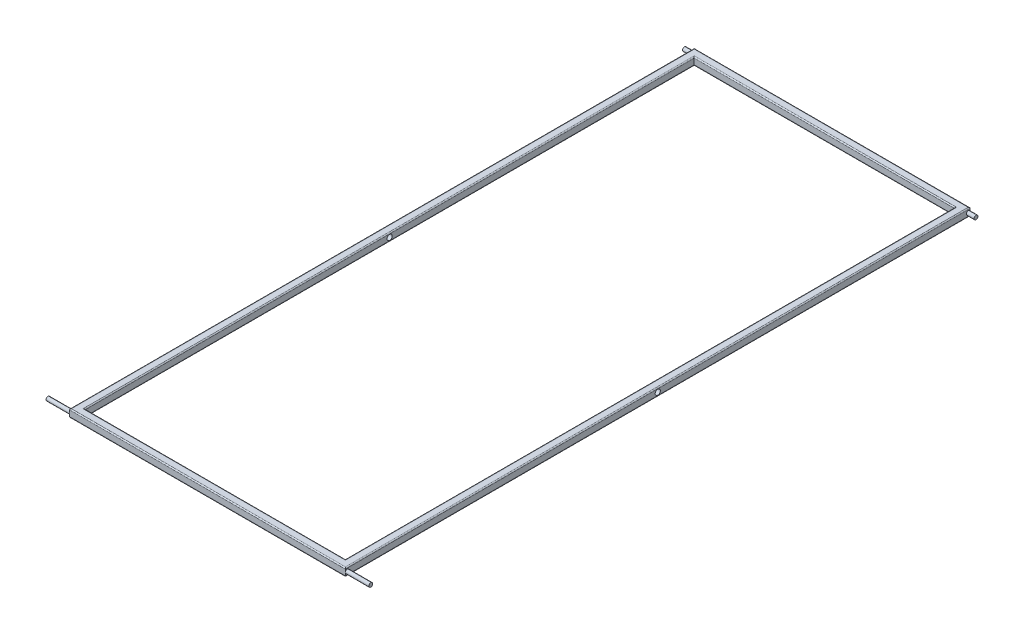
ISO-10303-21;
HEADER;
FILE_DESCRIPTION(('STEP AP214'),'2;1');
FILE_NAME('part.step','',(''),(''),'','','');
FILE_SCHEMA(('AUTOMOTIVE_DESIGN { 1 0 10303 214 1 1 1 1 }'));
ENDSEC;
DATA;
#1=APPLICATION_CONTEXT('core data for automotive mechanical design processes');
#2=APPLICATION_PROTOCOL_DEFINITION('international standard','automotive_design',2000,#1);
#3=PRODUCT_CONTEXT('',#1,'mechanical');
#4=PRODUCT('Part','Part','',(#3));
#5=PRODUCT_RELATED_PRODUCT_CATEGORY('part','',(#4));
#6=PRODUCT_DEFINITION_FORMATION('','',#4);
#7=PRODUCT_DEFINITION_CONTEXT('part definition',#1,'design');
#8=PRODUCT_DEFINITION('design','',#6,#7);
#9=PRODUCT_DEFINITION_SHAPE('','',#8);
#10=(LENGTH_UNIT() NAMED_UNIT(*) SI_UNIT(.MILLI.,.METRE.));
#11=(NAMED_UNIT(*) PLANE_ANGLE_UNIT() SI_UNIT($,.RADIAN.));
#12=(NAMED_UNIT(*) SI_UNIT($,.STERADIAN.) SOLID_ANGLE_UNIT());
#13=UNCERTAINTY_MEASURE_WITH_UNIT(LENGTH_MEASURE(1.E-05),#10,'distance_accuracy_value','');
#14=(GEOMETRIC_REPRESENTATION_CONTEXT(3) GLOBAL_UNCERTAINTY_ASSIGNED_CONTEXT((#13)) GLOBAL_UNIT_ASSIGNED_CONTEXT((#10,
#11,#12)) REPRESENTATION_CONTEXT('',''));
#15=CARTESIAN_POINT('',(0.,0.,0.));
#16=DIRECTION('',(0.,0.,1.));
#17=DIRECTION('',(1.,0.,0.));
#18=AXIS2_PLACEMENT_3D('',#15,#16,#17);
#19=CARTESIAN_POINT('',(0.,19.5,0.));
#20=DIRECTION('',(0.,-1.,0.));
#21=DIRECTION('',(0.,0.,-1.));
#22=AXIS2_PLACEMENT_3D('',#19,#20,#21);
#23=PLANE('',#22);
#24=DIRECTION('',(0.,0.,-1.));
#25=VECTOR('',#24,1.);
#26=CARTESIAN_POINT('',(327.6,19.5,760.5));
#27=LINE('',#26,#25);
#28=CARTESIAN_POINT('',(327.6,19.5,-763.1));
#29=VERTEX_POINT('',#28);
#30=CARTESIAN_POINT('',(327.6,19.5,763.1));
#31=VERTEX_POINT('',#30);
#32=EDGE_CURVE('E213',#29,#31,#27,.F.);
#33=ORIENTED_EDGE('',*,*,#32,.T.);
#34=DIRECTION('',(1.,0.,0.));
#35=VECTOR('',#34,1.);
#36=CARTESIAN_POINT('',(-325.,19.5,763.1));
#37=LINE('',#36,#35);
#38=CARTESIAN_POINT('',(-327.6,19.5,763.1));
#39=VERTEX_POINT('',#38);
#40=EDGE_CURVE('E222',#31,#39,#37,.F.);
#41=ORIENTED_EDGE('',*,*,#40,.T.);
#42=DIRECTION('',(0.,0.,1.));
#43=VECTOR('',#42,1.);
#44=CARTESIAN_POINT('',(-327.6,19.5,-760.5));
#45=LINE('',#44,#43);
#46=CARTESIAN_POINT('',(-327.6,19.5,-763.1));
#47=VERTEX_POINT('',#46);
#48=EDGE_CURVE('E219',#39,#47,#45,.F.);
#49=ORIENTED_EDGE('',*,*,#48,.T.);
#50=DIRECTION('',(-1.,0.,0.));
#51=VECTOR('',#50,1.);
#52=CARTESIAN_POINT('',(325.,19.5,-763.1));
#53=LINE('',#52,#51);
#54=EDGE_CURVE('E216',#47,#29,#53,.F.);
#55=ORIENTED_EDGE('',*,*,#54,.T.);
#56=EDGE_LOOP('',(#33,#41,#49,#55));
#57=FACE_BOUND('',#56,.T.);
#58=DIRECTION('',(1.,0.,0.));
#59=VECTOR('',#58,1.);
#60=CARTESIAN_POINT('',(0.,19.5,777.4));
#61=LINE('',#60,#59);
#62=CARTESIAN_POINT('',(-341.9,19.5,777.4));
#63=VERTEX_POINT('',#62);
#64=CARTESIAN_POINT('',(341.9,19.5,777.4));
#65=VERTEX_POINT('',#64);
#66=EDGE_CURVE('E206',#63,#65,#61,.T.);
#67=ORIENTED_EDGE('',*,*,#66,.T.);
#68=DIRECTION('',(0.,0.,-1.));
#69=VECTOR('',#68,1.);
#70=CARTESIAN_POINT('',(341.9,19.5,0.));
#71=LINE('',#70,#69);
#72=CARTESIAN_POINT('',(341.9,19.5,-777.4));
#73=VERTEX_POINT('',#72);
#74=EDGE_CURVE('E209',#65,#73,#71,.T.);
#75=ORIENTED_EDGE('',*,*,#74,.T.);
#76=DIRECTION('',(-1.,0.,0.));
#77=VECTOR('',#76,1.);
#78=CARTESIAN_POINT('',(0.,19.5,-777.4));
#79=LINE('',#78,#77);
#80=CARTESIAN_POINT('',(-341.9,19.5,-777.4));
#81=VERTEX_POINT('',#80);
#82=EDGE_CURVE('E200',#73,#81,#79,.T.);
#83=ORIENTED_EDGE('',*,*,#82,.T.);
#84=DIRECTION('',(0.,0.,1.));
#85=VECTOR('',#84,1.);
#86=CARTESIAN_POINT('',(-341.9,19.5,0.));
#87=LINE('',#86,#85);
#88=EDGE_CURVE('E203',#81,#63,#87,.T.);
#89=ORIENTED_EDGE('',*,*,#88,.T.);
#90=EDGE_LOOP('',(#67,#75,#83,#89));
#91=FACE_BOUND('',#90,.T.);
#92=ADVANCED_FACE('F39',(#57,#91),#23,.F.);
#93=CARTESIAN_POINT('',(0.,0.,0.));
#94=DIRECTION('',(0.,-1.,0.));
#95=DIRECTION('',(0.,0.,-1.));
#96=AXIS2_PLACEMENT_3D('',#93,#94,#95);
#97=PLANE('',#96);
#98=DIRECTION('',(-1.,0.,0.));
#99=VECTOR('',#98,1.);
#100=CARTESIAN_POINT('',(0.,0.,-763.1));
#101=LINE('',#100,#99);
#102=CARTESIAN_POINT('',(327.6,0.,-763.1));
#103=VERTEX_POINT('',#102);
#104=CARTESIAN_POINT('',(-327.6,0.,-763.1));
#105=VERTEX_POINT('',#104);
#106=EDGE_CURVE('E296',#103,#105,#101,.T.);
#107=ORIENTED_EDGE('',*,*,#106,.T.);
#108=DIRECTION('',(0.,0.,1.));
#109=VECTOR('',#108,1.);
#110=CARTESIAN_POINT('',(-327.6,0.,0.));
#111=LINE('',#110,#109);
#112=CARTESIAN_POINT('',(-327.6,0.,763.1));
#113=VERTEX_POINT('',#112);
#114=EDGE_CURVE('E299',#105,#113,#111,.T.);
#115=ORIENTED_EDGE('',*,*,#114,.T.);
#116=DIRECTION('',(1.,0.,0.));
#117=VECTOR('',#116,1.);
#118=CARTESIAN_POINT('',(0.,0.,763.1));
#119=LINE('',#118,#117);
#120=CARTESIAN_POINT('',(327.6,0.,763.1));
#121=VERTEX_POINT('',#120);
#122=EDGE_CURVE('E290',#113,#121,#119,.T.);
#123=ORIENTED_EDGE('',*,*,#122,.T.);
#124=DIRECTION('',(0.,0.,-1.));
#125=VECTOR('',#124,1.);
#126=CARTESIAN_POINT('',(327.6,0.,0.));
#127=LINE('',#126,#125);
#128=EDGE_CURVE('E293',#121,#103,#127,.T.);
#129=ORIENTED_EDGE('',*,*,#128,.T.);
#130=EDGE_LOOP('',(#107,#115,#123,#129));
#131=FACE_BOUND('',#130,.T.);
#132=DIRECTION('',(0.,0.,1.));
#133=VECTOR('',#132,1.);
#134=CARTESIAN_POINT('',(-341.9,0.,-780.));
#135=LINE('',#134,#133);
#136=CARTESIAN_POINT('',(-341.9,0.,777.4));
#137=VERTEX_POINT('',#136);
#138=CARTESIAN_POINT('',(-341.9,0.,-777.4));
#139=VERTEX_POINT('',#138);
#140=EDGE_CURVE('E283',#137,#139,#135,.F.);
#141=ORIENTED_EDGE('',*,*,#140,.T.);
#142=DIRECTION('',(-1.,0.,0.));
#143=VECTOR('',#142,1.);
#144=CARTESIAN_POINT('',(344.5,0.,-777.4));
#145=LINE('',#144,#143);
#146=CARTESIAN_POINT('',(341.9,0.,-777.4));
#147=VERTEX_POINT('',#146);
#148=EDGE_CURVE('E286',#139,#147,#145,.F.);
#149=ORIENTED_EDGE('',*,*,#148,.T.);
#150=DIRECTION('',(0.,0.,-1.));
#151=VECTOR('',#150,1.);
#152=CARTESIAN_POINT('',(341.9,0.,780.));
#153=LINE('',#152,#151);
#154=CARTESIAN_POINT('',(341.9,0.,777.4));
#155=VERTEX_POINT('',#154);
#156=EDGE_CURVE('E247',#147,#155,#153,.F.);
#157=ORIENTED_EDGE('',*,*,#156,.T.);
#158=DIRECTION('',(1.,0.,0.));
#159=VECTOR('',#158,1.);
#160=CARTESIAN_POINT('',(-344.5,0.,777.4));
#161=LINE('',#160,#159);
#162=EDGE_CURVE('E280',#155,#137,#161,.F.);
#163=ORIENTED_EDGE('',*,*,#162,.T.);
#164=EDGE_LOOP('',(#141,#149,#157,#163));
#165=FACE_BOUND('',#164,.T.);
#166=ADVANCED_FACE('F362',(#131,#165),#97,.T.);
#167=CARTESIAN_POINT('',(344.5,19.5,780.));
#168=DIRECTION('',(-1.,0.,0.));
#169=DIRECTION('',(0.,0.,1.));
#170=AXIS2_PLACEMENT_3D('',#167,#168,#169);
#171=PLANE('',#170);
#172=CARTESIAN_POINT('',(344.5,9.75,1.4432899320127E-13));
#173=DIRECTION('',(-1.,0.,0.));
#174=DIRECTION('',(0.,0.,1.));
#175=AXIS2_PLACEMENT_3D('',#172,#173,#174);
#176=CIRCLE('',#175,6.5);
#177=CARTESIAN_POINT('',(344.5,9.75,6.50000000000015));
#178=VERTEX_POINT('',#177);
#179=EDGE_CURVE('E411',#178,#178,#176,.T.);
#180=ORIENTED_EDGE('',*,*,#179,.T.);
#181=EDGE_LOOP('',(#180));
#182=FACE_BOUND('',#181,.T.);
#183=DIRECTION('',(0.,-1.,0.));
#184=VECTOR('',#183,1.);
#185=CARTESIAN_POINT('',(344.5,19.5,-780.));
#186=LINE('',#185,#184);
#187=CARTESIAN_POINT('',(344.5,9.75,-780.));
#188=VERTEX_POINT('',#187);
#189=CARTESIAN_POINT('',(344.5,2.6,-780.));
#190=VERTEX_POINT('',#189);
#191=EDGE_CURVE('E176',#188,#190,#186,.T.);
#192=ORIENTED_EDGE('',*,*,#191,.F.);
#193=CARTESIAN_POINT('',(344.5,9.75,-775.125));
#194=DIRECTION('',(-1.,0.,0.));
#195=DIRECTION('',(0.,0.,-1.));
#196=AXIS2_PLACEMENT_3D('',#193,#194,#195);
#197=CIRCLE('',#196,4.87499999999997);
#198=EDGE_CURVE('E55',#188,#188,#197,.T.);
#199=ORIENTED_EDGE('',*,*,#198,.T.);
#200=CARTESIAN_POINT('',(344.5,16.9,-780.));
#201=VERTEX_POINT('',#200);
#202=EDGE_CURVE('E193',#201,#188,#186,.T.);
#203=ORIENTED_EDGE('',*,*,#202,.F.);
#204=DIRECTION('',(0.,0.,-1.));
#205=VECTOR('',#204,1.);
#206=CARTESIAN_POINT('',(344.5,16.9,780.));
#207=LINE('',#206,#205);
#208=CARTESIAN_POINT('',(344.5,16.9,780.));
#209=VERTEX_POINT('',#208);
#210=EDGE_CURVE('E235',#201,#209,#207,.F.);
#211=ORIENTED_EDGE('',*,*,#210,.T.);
#212=DIRECTION('',(0.,-1.,0.));
#213=VECTOR('',#212,1.);
#214=CARTESIAN_POINT('',(344.5,19.5,780.));
#215=LINE('',#214,#213);
#216=CARTESIAN_POINT('',(344.5,9.75,780.));
#217=VERTEX_POINT('',#216);
#218=EDGE_CURVE('E375',#209,#217,#215,.T.);
#219=ORIENTED_EDGE('',*,*,#218,.T.);
#220=CARTESIAN_POINT('',(344.5,9.75,775.125));
#221=DIRECTION('',(-1.,0.,0.));
#222=DIRECTION('',(0.,0.,1.));
#223=AXIS2_PLACEMENT_3D('',#220,#221,#222);
#224=CIRCLE('',#223,4.87499999999997);
#225=EDGE_CURVE('E60',#217,#217,#224,.T.);
#226=ORIENTED_EDGE('',*,*,#225,.T.);
#227=CARTESIAN_POINT('',(344.5,2.6,780.));
#228=VERTEX_POINT('',#227);
#229=EDGE_CURVE('E378',#217,#228,#215,.T.);
#230=ORIENTED_EDGE('',*,*,#229,.T.);
#231=DIRECTION('',(0.,0.,-1.));
#232=VECTOR('',#231,1.);
#233=CARTESIAN_POINT('',(344.5,2.6,-780.));
#234=LINE('',#233,#232);
#235=EDGE_CURVE('E11',#228,#190,#234,.T.);
#236=ORIENTED_EDGE('',*,*,#235,.T.);
#237=EDGE_LOOP('',(#192,#199,#203,#211,#219,#226,#230,#236));
#238=FACE_BOUND('',#237,.T.);
#239=ADVANCED_FACE('F457',(#182,#238),#171,.F.);
#240=CARTESIAN_POINT('',(-344.5,19.5,-780.));
#241=DIRECTION('',(0.,0.,1.));
#242=DIRECTION('',(1.,0.,0.));
#243=AXIS2_PLACEMENT_3D('',#240,#241,#242);
#244=PLANE('',#243);
#245=ORIENTED_EDGE('',*,*,#202,.T.);
#246=ORIENTED_EDGE('',*,*,#191,.T.);
#247=DIRECTION('',(-1.,0.,0.));
#248=VECTOR('',#247,1.);
#249=CARTESIAN_POINT('',(-344.5,2.6,-780.));
#250=LINE('',#249,#248);
#251=CARTESIAN_POINT('',(-344.5,2.6,-780.));
#252=VERTEX_POINT('',#251);
#253=EDGE_CURVE('E183',#190,#252,#250,.T.);
#254=ORIENTED_EDGE('',*,*,#253,.T.);
#255=DIRECTION('',(0.,-1.,0.));
#256=VECTOR('',#255,1.);
#257=CARTESIAN_POINT('',(-344.5,19.5,-780.));
#258=LINE('',#257,#256);
#259=CARTESIAN_POINT('',(-344.5,9.75,-780.));
#260=VERTEX_POINT('',#259);
#261=EDGE_CURVE('E177',#260,#252,#258,.T.);
#262=ORIENTED_EDGE('',*,*,#261,.F.);
#263=CARTESIAN_POINT('',(-344.5,16.9,-780.));
#264=VERTEX_POINT('',#263);
#265=EDGE_CURVE('E165',#264,#260,#258,.T.);
#266=ORIENTED_EDGE('',*,*,#265,.F.);
#267=DIRECTION('',(-1.,0.,0.));
#268=VECTOR('',#267,1.);
#269=CARTESIAN_POINT('',(-344.5,16.9,-780.));
#270=LINE('',#269,#268);
#271=EDGE_CURVE('E244',#264,#201,#270,.F.);
#272=ORIENTED_EDGE('',*,*,#271,.T.);
#273=EDGE_LOOP('',(#245,#246,#254,#262,#266,#272));
#274=FACE_BOUND('',#273,.T.);
#275=ADVANCED_FACE('F181',(#274),#244,.F.);
#276=CARTESIAN_POINT('',(-344.5,19.5,780.));
#277=DIRECTION('',(1.,0.,0.));
#278=DIRECTION('',(0.,0.,-1.));
#279=AXIS2_PLACEMENT_3D('',#276,#277,#278);
#280=PLANE('',#279);
#281=CARTESIAN_POINT('',(-344.5,9.75,1.4432899320127E-13));
#282=DIRECTION('',(-1.,0.,0.));
#283=DIRECTION('',(0.,0.,1.));
#284=AXIS2_PLACEMENT_3D('',#281,#282,#283);
#285=CIRCLE('',#284,6.5);
#286=CARTESIAN_POINT('',(-344.5,9.75,6.50000000000015));
#287=VERTEX_POINT('',#286);
#288=EDGE_CURVE('E422',#287,#287,#285,.T.);
#289=ORIENTED_EDGE('',*,*,#288,.F.);
#290=EDGE_LOOP('',(#289));
#291=FACE_BOUND('',#290,.T.);
#292=ORIENTED_EDGE('',*,*,#265,.T.);
#293=CARTESIAN_POINT('',(-344.5,9.75,-775.125));
#294=DIRECTION('',(-1.,0.,0.));
#295=DIRECTION('',(0.,0.,-1.));
#296=AXIS2_PLACEMENT_3D('',#293,#294,#295);
#297=CIRCLE('',#296,4.87499999999997);
#298=EDGE_CURVE('E169',#260,#260,#297,.T.);
#299=ORIENTED_EDGE('',*,*,#298,.F.);
#300=ORIENTED_EDGE('',*,*,#261,.T.);
#301=DIRECTION('',(0.,0.,1.));
#302=VECTOR('',#301,1.);
#303=CARTESIAN_POINT('',(-344.5,2.6,780.));
#304=LINE('',#303,#302);
#305=CARTESIAN_POINT('',(-344.5,2.6,780.));
#306=VERTEX_POINT('',#305);
#307=EDGE_CURVE('E318',#252,#306,#304,.T.);
#308=ORIENTED_EDGE('',*,*,#307,.T.);
#309=DIRECTION('',(0.,-1.,0.));
#310=VECTOR('',#309,1.);
#311=CARTESIAN_POINT('',(-344.5,19.5,780.));
#312=LINE('',#311,#310);
#313=CARTESIAN_POINT('',(-344.5,9.75,780.));
#314=VERTEX_POINT('',#313);
#315=EDGE_CURVE('E189',#314,#306,#312,.T.);
#316=ORIENTED_EDGE('',*,*,#315,.F.);
#317=CARTESIAN_POINT('',(-344.5,9.75,775.125));
#318=DIRECTION('',(-1.,0.,0.));
#319=DIRECTION('',(0.,0.,1.));
#320=AXIS2_PLACEMENT_3D('',#317,#318,#319);
#321=CIRCLE('',#320,4.87499999999997);
#322=EDGE_CURVE('E342',#314,#314,#321,.T.);
#323=ORIENTED_EDGE('',*,*,#322,.F.);
#324=CARTESIAN_POINT('',(-344.5,16.9,780.));
#325=VERTEX_POINT('',#324);
#326=EDGE_CURVE('E187',#325,#314,#312,.T.);
#327=ORIENTED_EDGE('',*,*,#326,.F.);
#328=DIRECTION('',(0.,0.,1.));
#329=VECTOR('',#328,1.);
#330=CARTESIAN_POINT('',(-344.5,16.9,780.));
#331=LINE('',#330,#329);
#332=EDGE_CURVE('E172',#325,#264,#331,.F.);
#333=ORIENTED_EDGE('',*,*,#332,.T.);
#334=EDGE_LOOP('',(#292,#299,#300,#308,#316,#323,#327,#333));
#335=FACE_BOUND('',#334,.T.);
#336=ADVANCED_FACE('F167',(#291,#335),#280,.F.);
#337=CARTESIAN_POINT('',(-344.5,19.5,780.));
#338=DIRECTION('',(0.,0.,-1.));
#339=DIRECTION('',(-1.,0.,0.));
#340=AXIS2_PLACEMENT_3D('',#337,#338,#339);
#341=PLANE('',#340);
#342=ORIENTED_EDGE('',*,*,#326,.T.);
#343=ORIENTED_EDGE('',*,*,#315,.T.);
#344=DIRECTION('',(1.,0.,0.));
#345=VECTOR('',#344,1.);
#346=CARTESIAN_POINT('',(344.5,2.6,780.));
#347=LINE('',#346,#345);
#348=EDGE_CURVE('E49',#306,#228,#347,.T.);
#349=ORIENTED_EDGE('',*,*,#348,.T.);
#350=ORIENTED_EDGE('',*,*,#229,.F.);
#351=ORIENTED_EDGE('',*,*,#218,.F.);
#352=DIRECTION('',(1.,0.,0.));
#353=VECTOR('',#352,1.);
#354=CARTESIAN_POINT('',(-344.5,16.9,780.));
#355=LINE('',#354,#353);
#356=EDGE_CURVE('E239',#209,#325,#355,.F.);
#357=ORIENTED_EDGE('',*,*,#356,.T.);
#358=EDGE_LOOP('',(#342,#343,#349,#350,#351,#357));
#359=FACE_BOUND('',#358,.T.);
#360=ADVANCED_FACE('F465',(#359),#341,.F.);
#361=CARTESIAN_POINT('',(325.,19.5,760.5));
#362=DIRECTION('',(-1.,0.,0.));
#363=DIRECTION('',(0.,0.,1.));
#364=AXIS2_PLACEMENT_3D('',#361,#362,#363);
#365=PLANE('',#364);
#366=CARTESIAN_POINT('',(325.,9.75,1.4432899320127E-13));
#367=DIRECTION('',(-1.,0.,0.));
#368=DIRECTION('',(0.,0.,1.));
#369=AXIS2_PLACEMENT_3D('',#366,#367,#368);
#370=CIRCLE('',#369,6.5);
#371=CARTESIAN_POINT('',(325.,9.75,6.50000000000015));
#372=VERTEX_POINT('',#371);
#373=EDGE_CURVE('E418',#372,#372,#370,.T.);
#374=ORIENTED_EDGE('',*,*,#373,.F.);
#375=EDGE_LOOP('',(#374));
#376=FACE_BOUND('',#375,.T.);
#377=DIRECTION('',(0.,-1.,0.));
#378=VECTOR('',#377,1.);
#379=CARTESIAN_POINT('',(325.,19.5,-760.5));
#380=LINE('',#379,#378);
#381=CARTESIAN_POINT('',(325.,16.9,-760.5));
#382=VERTEX_POINT('',#381);
#383=CARTESIAN_POINT('',(325.,2.6,-760.5));
#384=VERTEX_POINT('',#383);
#385=EDGE_CURVE('E382',#382,#384,#380,.T.);
#386=ORIENTED_EDGE('',*,*,#385,.T.);
#387=DIRECTION('',(0.,0.,-1.));
#388=VECTOR('',#387,1.);
#389=CARTESIAN_POINT('',(325.,2.6,760.5));
#390=LINE('',#389,#388);
#391=CARTESIAN_POINT('',(325.,2.6,760.5));
#392=VERTEX_POINT('',#391);
#393=EDGE_CURVE('E310',#384,#392,#390,.F.);
#394=ORIENTED_EDGE('',*,*,#393,.T.);
#395=DIRECTION('',(0.,-1.,0.));
#396=VECTOR('',#395,1.);
#397=CARTESIAN_POINT('',(325.,19.5,760.5));
#398=LINE('',#397,#396);
#399=CARTESIAN_POINT('',(325.,16.9,760.5));
#400=VERTEX_POINT('',#399);
#401=EDGE_CURVE('E263',#400,#392,#398,.T.);
#402=ORIENTED_EDGE('',*,*,#401,.F.);
#403=DIRECTION('',(0.,0.,-1.));
#404=VECTOR('',#403,1.);
#405=CARTESIAN_POINT('',(325.,16.9,-760.5));
#406=LINE('',#405,#404);
#407=EDGE_CURVE('E232',#400,#382,#406,.T.);
#408=ORIENTED_EDGE('',*,*,#407,.T.);
#409=EDGE_LOOP('',(#386,#394,#402,#408));
#410=FACE_BOUND('',#409,.T.);
#411=ADVANCED_FACE('F462',(#376,#410),#365,.T.);
#412=CARTESIAN_POINT('',(-325.,19.5,-760.5));
#413=DIRECTION('',(0.,0.,1.));
#414=DIRECTION('',(1.,0.,0.));
#415=AXIS2_PLACEMENT_3D('',#412,#413,#414);
#416=PLANE('',#415);
#417=DIRECTION('',(0.,-1.,0.));
#418=VECTOR('',#417,1.);
#419=CARTESIAN_POINT('',(-325.,19.5,-760.5));
#420=LINE('',#419,#418);
#421=CARTESIAN_POINT('',(-325.,16.9,-760.5));
#422=VERTEX_POINT('',#421);
#423=CARTESIAN_POINT('',(-325.,2.6,-760.5));
#424=VERTEX_POINT('',#423);
#425=EDGE_CURVE('E387',#422,#424,#420,.T.);
#426=ORIENTED_EDGE('',*,*,#425,.T.);
#427=DIRECTION('',(-1.,0.,0.));
#428=VECTOR('',#427,1.);
#429=CARTESIAN_POINT('',(-325.,2.6,-760.5));
#430=LINE('',#429,#428);
#431=EDGE_CURVE('E307',#424,#384,#430,.F.);
#432=ORIENTED_EDGE('',*,*,#431,.T.);
#433=ORIENTED_EDGE('',*,*,#385,.F.);
#434=DIRECTION('',(-1.,0.,0.));
#435=VECTOR('',#434,1.);
#436=CARTESIAN_POINT('',(-325.,16.9,-760.5));
#437=LINE('',#436,#435);
#438=EDGE_CURVE('E229',#382,#422,#437,.T.);
#439=ORIENTED_EDGE('',*,*,#438,.T.);
#440=EDGE_LOOP('',(#426,#432,#433,#439));
#441=FACE_BOUND('',#440,.T.);
#442=ADVANCED_FACE('F593',(#441),#416,.T.);
#443=CARTESIAN_POINT('',(-325.,19.5,760.5));
#444=DIRECTION('',(1.,0.,0.));
#445=DIRECTION('',(0.,0.,-1.));
#446=AXIS2_PLACEMENT_3D('',#443,#444,#445);
#447=PLANE('',#446);
#448=CARTESIAN_POINT('',(-325.,9.75,1.4432899320127E-13));
#449=DIRECTION('',(1.,0.,0.));
#450=DIRECTION('',(0.,0.,-1.));
#451=AXIS2_PLACEMENT_3D('',#448,#449,#450);
#452=CIRCLE('',#451,6.5);
#453=CARTESIAN_POINT('',(-325.,9.75,-6.49999999999986));
#454=VERTEX_POINT('',#453);
#455=EDGE_CURVE('E43',#454,#454,#452,.T.);
#456=ORIENTED_EDGE('',*,*,#455,.F.);
#457=EDGE_LOOP('',(#456));
#458=FACE_BOUND('',#457,.T.);
#459=DIRECTION('',(0.,-1.,0.));
#460=VECTOR('',#459,1.);
#461=CARTESIAN_POINT('',(-325.,19.5,760.5));
#462=LINE('',#461,#460);
#463=CARTESIAN_POINT('',(-325.,16.9,760.5));
#464=VERTEX_POINT('',#463);
#465=CARTESIAN_POINT('',(-325.,2.6,760.5));
#466=VERTEX_POINT('',#465);
#467=EDGE_CURVE('E391',#464,#466,#462,.T.);
#468=ORIENTED_EDGE('',*,*,#467,.T.);
#469=DIRECTION('',(0.,0.,1.));
#470=VECTOR('',#469,1.);
#471=CARTESIAN_POINT('',(-325.,2.6,760.5));
#472=LINE('',#471,#470);
#473=EDGE_CURVE('E303',#466,#424,#472,.F.);
#474=ORIENTED_EDGE('',*,*,#473,.T.);
#475=ORIENTED_EDGE('',*,*,#425,.F.);
#476=DIRECTION('',(0.,0.,1.));
#477=VECTOR('',#476,1.);
#478=CARTESIAN_POINT('',(-325.,16.9,760.5));
#479=LINE('',#478,#477);
#480=EDGE_CURVE('E226',#422,#464,#479,.T.);
#481=ORIENTED_EDGE('',*,*,#480,.T.);
#482=EDGE_LOOP('',(#468,#474,#475,#481));
#483=FACE_BOUND('',#482,.T.);
#484=ADVANCED_FACE('F586',(#458,#483),#447,.T.);
#485=CARTESIAN_POINT('',(-325.,19.5,760.5));
#486=DIRECTION('',(0.,0.,-1.));
#487=DIRECTION('',(-1.,0.,0.));
#488=AXIS2_PLACEMENT_3D('',#485,#486,#487);
#489=PLANE('',#488);
#490=ORIENTED_EDGE('',*,*,#401,.T.);
#491=DIRECTION('',(1.,0.,0.));
#492=VECTOR('',#491,1.);
#493=CARTESIAN_POINT('',(-325.,2.6,760.5));
#494=LINE('',#493,#492);
#495=EDGE_CURVE('E313',#392,#466,#494,.F.);
#496=ORIENTED_EDGE('',*,*,#495,.T.);
#497=ORIENTED_EDGE('',*,*,#467,.F.);
#498=DIRECTION('',(1.,0.,0.));
#499=VECTOR('',#498,1.);
#500=CARTESIAN_POINT('',(325.,16.9,760.5));
#501=LINE('',#500,#499);
#502=EDGE_CURVE('E196',#464,#400,#501,.T.);
#503=ORIENTED_EDGE('',*,*,#502,.T.);
#504=EDGE_LOOP('',(#490,#496,#497,#503));
#505=FACE_BOUND('',#504,.T.);
#506=ADVANCED_FACE('F492',(#505),#489,.T.);
#507=CARTESIAN_POINT('',(-325.,16.9,-763.1));
#508=DIRECTION('',(1.,0.,0.));
#509=DIRECTION('',(0.,0.,-1.));
#510=AXIS2_PLACEMENT_3D('',#507,#508,#509);
#511=CYLINDRICAL_SURFACE('',#510,2.6);
#512=CARTESIAN_POINT('',(327.6,16.9,-763.1));
#513=DIRECTION('',(0.707106781186547,0.,0.707106781186547));
#514=DIRECTION('',(0.707106781186547,0.,-0.707106781186547));
#515=AXIS2_PLACEMENT_3D('',#512,#513,#514);
#516=ELLIPSE('',#515,3.67695526217005,2.6);
#517=EDGE_CURVE('E255',#29,#382,#516,.T.);
#518=ORIENTED_EDGE('',*,*,#517,.F.);
#519=ORIENTED_EDGE('',*,*,#54,.F.);
#520=CARTESIAN_POINT('',(-327.6,16.9,-763.1));
#521=DIRECTION('',(0.707106781186547,0.,-0.707106781186547));
#522=DIRECTION('',(-0.707106781186547,0.,-0.707106781186547));
#523=AXIS2_PLACEMENT_3D('',#520,#521,#522);
#524=ELLIPSE('',#523,3.67695526217005,2.6);
#525=EDGE_CURVE('E259',#422,#47,#524,.F.);
#526=ORIENTED_EDGE('',*,*,#525,.F.);
#527=ORIENTED_EDGE('',*,*,#438,.F.);
#528=EDGE_LOOP('',(#518,#519,#526,#527));
#529=FACE_BOUND('',#528,.T.);
#530=ADVANCED_FACE('F488',(#529),#511,.T.);
#531=CARTESIAN_POINT('',(-327.6,16.9,760.5));
#532=DIRECTION('',(0.,0.,-1.));
#533=DIRECTION('',(-1.,0.,0.));
#534=AXIS2_PLACEMENT_3D('',#531,#532,#533);
#535=CYLINDRICAL_SURFACE('',#534,2.6);
#536=ORIENTED_EDGE('',*,*,#525,.T.);
#537=ORIENTED_EDGE('',*,*,#48,.F.);
#538=CARTESIAN_POINT('',(-327.6,16.9,763.1));
#539=DIRECTION('',(-0.707106781186547,0.,-0.707106781186547));
#540=DIRECTION('',(-0.707106781186547,0.,0.707106781186547));
#541=AXIS2_PLACEMENT_3D('',#538,#539,#540);
#542=ELLIPSE('',#541,3.67695526217005,2.6);
#543=EDGE_CURVE('E251',#464,#39,#542,.F.);
#544=ORIENTED_EDGE('',*,*,#543,.F.);
#545=ORIENTED_EDGE('',*,*,#480,.F.);
#546=EDGE_LOOP('',(#536,#537,#544,#545));
#547=FACE_BOUND('',#546,.T.);
#548=ADVANCED_FACE('F484',(#547),#535,.T.);
#549=CARTESIAN_POINT('',(327.6,16.9,760.5));
#550=DIRECTION('',(0.,0.,1.));
#551=DIRECTION('',(1.,0.,0.));
#552=AXIS2_PLACEMENT_3D('',#549,#550,#551);
#553=CYLINDRICAL_SURFACE('',#552,2.6);
#554=ORIENTED_EDGE('',*,*,#517,.T.);
#555=ORIENTED_EDGE('',*,*,#407,.F.);
#556=CARTESIAN_POINT('',(327.6,16.9,763.1));
#557=DIRECTION('',(-0.707106781186547,0.,0.707106781186547));
#558=DIRECTION('',(-0.707106781186547,0.,-0.707106781186547));
#559=AXIS2_PLACEMENT_3D('',#556,#557,#558);
#560=ELLIPSE('',#559,3.67695526217005,2.6);
#561=EDGE_CURVE('E248',#31,#400,#560,.T.);
#562=ORIENTED_EDGE('',*,*,#561,.F.);
#563=ORIENTED_EDGE('',*,*,#32,.F.);
#564=EDGE_LOOP('',(#554,#555,#562,#563));
#565=FACE_BOUND('',#564,.T.);
#566=ADVANCED_FACE('F480',(#565),#553,.T.);
#567=CARTESIAN_POINT('',(-325.,16.9,763.1));
#568=DIRECTION('',(-1.,0.,0.));
#569=DIRECTION('',(0.,0.,1.));
#570=AXIS2_PLACEMENT_3D('',#567,#568,#569);
#571=CYLINDRICAL_SURFACE('',#570,2.6);
#572=ORIENTED_EDGE('',*,*,#543,.T.);
#573=ORIENTED_EDGE('',*,*,#40,.F.);
#574=ORIENTED_EDGE('',*,*,#561,.T.);
#575=ORIENTED_EDGE('',*,*,#502,.F.);
#576=EDGE_LOOP('',(#572,#573,#574,#575));
#577=FACE_BOUND('',#576,.T.);
#578=ADVANCED_FACE('F476',(#577),#571,.T.);
#579=CARTESIAN_POINT('',(-341.9,16.9,0.));
#580=DIRECTION('',(0.,0.,1.));
#581=DIRECTION('',(1.,0.,0.));
#582=AXIS2_PLACEMENT_3D('',#579,#580,#581);
#583=CYLINDRICAL_SURFACE('',#582,2.6);
#584=CARTESIAN_POINT('',(-341.9,16.9,-777.4));
#585=DIRECTION('',(-0.707106781186547,0.,0.707106781186547));
#586=DIRECTION('',(-0.707106781186547,0.,-0.707106781186547));
#587=AXIS2_PLACEMENT_3D('',#584,#585,#586);
#588=ELLIPSE('',#587,3.67695526217005,2.6);
#589=EDGE_CURVE('E271',#264,#81,#588,.F.);
#590=ORIENTED_EDGE('',*,*,#589,.F.);
#591=ORIENTED_EDGE('',*,*,#332,.F.);
#592=CARTESIAN_POINT('',(-341.9,16.9,777.4));
#593=DIRECTION('',(0.707106781186547,0.,0.707106781186547));
#594=DIRECTION('',(-0.707106781186547,0.,0.707106781186547));
#595=AXIS2_PLACEMENT_3D('',#592,#593,#594);
#596=ELLIPSE('',#595,3.67695526217005,2.6);
#597=EDGE_CURVE('E252',#63,#325,#596,.T.);
#598=ORIENTED_EDGE('',*,*,#597,.F.);
#599=ORIENTED_EDGE('',*,*,#88,.F.);
#600=EDGE_LOOP('',(#590,#591,#598,#599));
#601=FACE_BOUND('',#600,.T.);
#602=ADVANCED_FACE('F479',(#601),#583,.T.);
#603=CARTESIAN_POINT('',(0.,16.9,777.4));
#604=DIRECTION('',(1.,0.,0.));
#605=DIRECTION('',(0.,0.,-1.));
#606=AXIS2_PLACEMENT_3D('',#603,#604,#605);
#607=CYLINDRICAL_SURFACE('',#606,2.6);
#608=ORIENTED_EDGE('',*,*,#597,.T.);
#609=ORIENTED_EDGE('',*,*,#356,.F.);
#610=CARTESIAN_POINT('',(341.9,16.9,777.4));
#611=DIRECTION('',(0.707106781186547,0.,-0.707106781186547));
#612=DIRECTION('',(0.707106781186547,0.,0.707106781186547));
#613=AXIS2_PLACEMENT_3D('',#610,#611,#612);
#614=ELLIPSE('',#613,3.67695526217005,2.6);
#615=EDGE_CURVE('E267',#65,#209,#614,.T.);
#616=ORIENTED_EDGE('',*,*,#615,.F.);
#617=ORIENTED_EDGE('',*,*,#66,.F.);
#618=EDGE_LOOP('',(#608,#609,#616,#617));
#619=FACE_BOUND('',#618,.T.);
#620=ADVANCED_FACE('F502',(#619),#607,.T.);
#621=CARTESIAN_POINT('',(0.,16.9,-777.4));
#622=DIRECTION('',(-1.,0.,0.));
#623=DIRECTION('',(0.,0.,1.));
#624=AXIS2_PLACEMENT_3D('',#621,#622,#623);
#625=CYLINDRICAL_SURFACE('',#624,2.6);
#626=ORIENTED_EDGE('',*,*,#589,.T.);
#627=ORIENTED_EDGE('',*,*,#82,.F.);
#628=CARTESIAN_POINT('',(341.9,16.9,-777.4));
#629=DIRECTION('',(-0.707106781186547,0.,-0.707106781186547));
#630=DIRECTION('',(-0.707106781186547,0.,0.707106781186547));
#631=AXIS2_PLACEMENT_3D('',#628,#629,#630);
#632=ELLIPSE('',#631,3.67695526217005,2.6);
#633=EDGE_CURVE('E264',#201,#73,#632,.F.);
#634=ORIENTED_EDGE('',*,*,#633,.F.);
#635=ORIENTED_EDGE('',*,*,#271,.F.);
#636=EDGE_LOOP('',(#626,#627,#634,#635));
#637=FACE_BOUND('',#636,.T.);
#638=ADVANCED_FACE('F498',(#637),#625,.T.);
#639=CARTESIAN_POINT('',(341.9,16.9,0.));
#640=DIRECTION('',(0.,0.,-1.));
#641=DIRECTION('',(-1.,0.,0.));
#642=AXIS2_PLACEMENT_3D('',#639,#640,#641);
#643=CYLINDRICAL_SURFACE('',#642,2.6);
#644=ORIENTED_EDGE('',*,*,#615,.T.);
#645=ORIENTED_EDGE('',*,*,#210,.F.);
#646=ORIENTED_EDGE('',*,*,#633,.T.);
#647=ORIENTED_EDGE('',*,*,#74,.F.);
#648=EDGE_LOOP('',(#644,#645,#646,#647));
#649=FACE_BOUND('',#648,.T.);
#650=ADVANCED_FACE('F494',(#649),#643,.T.);
#651=CARTESIAN_POINT('',(327.6,2.6,0.));
#652=DIRECTION('',(0.,0.,-1.));
#653=DIRECTION('',(-1.,0.,0.));
#654=AXIS2_PLACEMENT_3D('',#651,#652,#653);
#655=CYLINDRICAL_SURFACE('',#654,2.6);
#656=CARTESIAN_POINT('',(327.6,2.6,763.1));
#657=DIRECTION('',(0.707106781186547,0.,-0.707106781186547));
#658=DIRECTION('',(-0.707106781186547,0.,-0.707106781186547));
#659=AXIS2_PLACEMENT_3D('',#656,#657,#658);
#660=ELLIPSE('',#659,3.67695526217005,2.6);
#661=EDGE_CURVE('E331',#392,#121,#660,.F.);
#662=ORIENTED_EDGE('',*,*,#661,.F.);
#663=ORIENTED_EDGE('',*,*,#393,.F.);
#664=CARTESIAN_POINT('',(327.6,2.6,-763.1));
#665=DIRECTION('',(-0.707106781186547,0.,-0.707106781186547));
#666=DIRECTION('',(-0.707106781186547,0.,0.707106781186547));
#667=AXIS2_PLACEMENT_3D('',#664,#665,#666);
#668=ELLIPSE('',#667,3.67695526217005,2.6);
#669=EDGE_CURVE('E268',#103,#384,#668,.T.);
#670=ORIENTED_EDGE('',*,*,#669,.F.);
#671=ORIENTED_EDGE('',*,*,#128,.F.);
#672=EDGE_LOOP('',(#662,#663,#670,#671));
#673=FACE_BOUND('',#672,.T.);
#674=ADVANCED_FACE('F497',(#673),#655,.T.);
#675=CARTESIAN_POINT('',(0.,2.6,-763.1));
#676=DIRECTION('',(-1.,0.,0.));
#677=DIRECTION('',(0.,0.,1.));
#678=AXIS2_PLACEMENT_3D('',#675,#676,#677);
#679=CYLINDRICAL_SURFACE('',#678,2.6);
#680=ORIENTED_EDGE('',*,*,#669,.T.);
#681=ORIENTED_EDGE('',*,*,#431,.F.);
#682=CARTESIAN_POINT('',(-327.6,2.6,-763.1));
#683=DIRECTION('',(-0.707106781186547,0.,0.707106781186547));
#684=DIRECTION('',(0.707106781186547,0.,0.707106781186547));
#685=AXIS2_PLACEMENT_3D('',#682,#683,#684);
#686=ELLIPSE('',#685,3.67695526217005,2.6);
#687=EDGE_CURVE('E327',#105,#424,#686,.T.);
#688=ORIENTED_EDGE('',*,*,#687,.F.);
#689=ORIENTED_EDGE('',*,*,#106,.F.);
#690=EDGE_LOOP('',(#680,#681,#688,#689));
#691=FACE_BOUND('',#690,.T.);
#692=ADVANCED_FACE('F517',(#691),#679,.T.);
#693=CARTESIAN_POINT('',(0.,2.6,763.1));
#694=DIRECTION('',(1.,0.,0.));
#695=DIRECTION('',(0.,0.,-1.));
#696=AXIS2_PLACEMENT_3D('',#693,#694,#695);
#697=CYLINDRICAL_SURFACE('',#696,2.6);
#698=ORIENTED_EDGE('',*,*,#661,.T.);
#699=ORIENTED_EDGE('',*,*,#122,.F.);
#700=CARTESIAN_POINT('',(-327.6,2.6,763.1));
#701=DIRECTION('',(0.707106781186547,0.,0.707106781186547));
#702=DIRECTION('',(-0.707106781186547,0.,0.707106781186547));
#703=AXIS2_PLACEMENT_3D('',#700,#701,#702);
#704=ELLIPSE('',#703,3.67695526217005,2.6);
#705=EDGE_CURVE('E324',#466,#113,#704,.F.);
#706=ORIENTED_EDGE('',*,*,#705,.F.);
#707=ORIENTED_EDGE('',*,*,#495,.F.);
#708=EDGE_LOOP('',(#698,#699,#706,#707));
#709=FACE_BOUND('',#708,.T.);
#710=ADVANCED_FACE('F513',(#709),#697,.T.);
#711=CARTESIAN_POINT('',(-327.6,2.6,0.));
#712=DIRECTION('',(0.,0.,1.));
#713=DIRECTION('',(1.,0.,0.));
#714=AXIS2_PLACEMENT_3D('',#711,#712,#713);
#715=CYLINDRICAL_SURFACE('',#714,2.6);
#716=ORIENTED_EDGE('',*,*,#687,.T.);
#717=ORIENTED_EDGE('',*,*,#473,.F.);
#718=ORIENTED_EDGE('',*,*,#705,.T.);
#719=ORIENTED_EDGE('',*,*,#114,.F.);
#720=EDGE_LOOP('',(#716,#717,#718,#719));
#721=FACE_BOUND('',#720,.T.);
#722=ADVANCED_FACE('F510',(#721),#715,.T.);
#723=CARTESIAN_POINT('',(-344.5,2.6,777.4));
#724=DIRECTION('',(-1.,0.,0.));
#725=DIRECTION('',(0.,0.,1.));
#726=AXIS2_PLACEMENT_3D('',#723,#724,#725);
#727=CYLINDRICAL_SURFACE('',#726,2.6);
#728=CARTESIAN_POINT('',(-341.9,2.6,777.4));
#729=DIRECTION('',(-0.707106781186547,0.,-0.707106781186547));
#730=DIRECTION('',(-0.707106781186547,0.,0.707106781186547));
#731=AXIS2_PLACEMENT_3D('',#728,#729,#730);
#732=ELLIPSE('',#731,3.67695526217005,2.6);
#733=EDGE_CURVE('E345',#137,#306,#732,.T.);
#734=ORIENTED_EDGE('',*,*,#733,.F.);
#735=ORIENTED_EDGE('',*,*,#162,.F.);
#736=CARTESIAN_POINT('',(341.9,2.6,777.4));
#737=DIRECTION('',(-0.707106781186547,0.,0.707106781186547));
#738=DIRECTION('',(0.707106781186547,0.,0.707106781186547));
#739=AXIS2_PLACEMENT_3D('',#736,#737,#738);
#740=ELLIPSE('',#739,3.67695526217005,2.6);
#741=EDGE_CURVE('E328',#228,#155,#740,.F.);
#742=ORIENTED_EDGE('',*,*,#741,.F.);
#743=ORIENTED_EDGE('',*,*,#348,.F.);
#744=EDGE_LOOP('',(#734,#735,#742,#743));
#745=FACE_BOUND('',#744,.T.);
#746=ADVANCED_FACE('F41',(#745),#727,.T.);
#747=CARTESIAN_POINT('',(341.9,2.6,780.));
#748=DIRECTION('',(0.,0.,1.));
#749=DIRECTION('',(1.,0.,0.));
#750=AXIS2_PLACEMENT_3D('',#747,#748,#749);
#751=CYLINDRICAL_SURFACE('',#750,2.6);
#752=ORIENTED_EDGE('',*,*,#741,.T.);
#753=ORIENTED_EDGE('',*,*,#156,.F.);
#754=CARTESIAN_POINT('',(341.9,2.6,-777.4));
#755=DIRECTION('',(0.707106781186547,0.,0.707106781186547));
#756=DIRECTION('',(-0.707106781186547,0.,0.707106781186547));
#757=AXIS2_PLACEMENT_3D('',#754,#755,#756);
#758=ELLIPSE('',#757,3.67695526217005,2.6);
#759=EDGE_CURVE('E341',#190,#147,#758,.F.);
#760=ORIENTED_EDGE('',*,*,#759,.F.);
#761=ORIENTED_EDGE('',*,*,#235,.F.);
#762=EDGE_LOOP('',(#752,#753,#760,#761));
#763=FACE_BOUND('',#762,.T.);
#764=ADVANCED_FACE('F354',(#763),#751,.T.);
#765=CARTESIAN_POINT('',(-341.9,2.6,780.));
#766=DIRECTION('',(0.,0.,-1.));
#767=DIRECTION('',(-1.,0.,0.));
#768=AXIS2_PLACEMENT_3D('',#765,#766,#767);
#769=CYLINDRICAL_SURFACE('',#768,2.6);
#770=ORIENTED_EDGE('',*,*,#733,.T.);
#771=ORIENTED_EDGE('',*,*,#307,.F.);
#772=CARTESIAN_POINT('',(-341.9,2.6,-777.4));
#773=DIRECTION('',(0.707106781186547,0.,-0.707106781186547));
#774=DIRECTION('',(-0.707106781186547,0.,-0.707106781186547));
#775=AXIS2_PLACEMENT_3D('',#772,#773,#774);
#776=ELLIPSE('',#775,3.67695526217005,2.6);
#777=EDGE_CURVE('E338',#139,#252,#776,.T.);
#778=ORIENTED_EDGE('',*,*,#777,.F.);
#779=ORIENTED_EDGE('',*,*,#140,.F.);
#780=EDGE_LOOP('',(#770,#771,#778,#779));
#781=FACE_BOUND('',#780,.T.);
#782=ADVANCED_FACE('F369',(#781),#769,.T.);
#783=CARTESIAN_POINT('',(-344.5,2.6,-777.4));
#784=DIRECTION('',(1.,0.,0.));
#785=DIRECTION('',(0.,0.,-1.));
#786=AXIS2_PLACEMENT_3D('',#783,#784,#785);
#787=CYLINDRICAL_SURFACE('',#786,2.6);
#788=ORIENTED_EDGE('',*,*,#759,.T.);
#789=ORIENTED_EDGE('',*,*,#148,.F.);
#790=ORIENTED_EDGE('',*,*,#777,.T.);
#791=ORIENTED_EDGE('',*,*,#253,.F.);
#792=EDGE_LOOP('',(#788,#789,#790,#791));
#793=FACE_BOUND('',#792,.T.);
#794=ADVANCED_FACE('F366',(#793),#787,.T.);
#795=CARTESIAN_POINT('',(-364.,9.75,775.125));
#796=DIRECTION('',(1.,0.,0.));
#797=DIRECTION('',(0.,0.,-1.));
#798=AXIS2_PLACEMENT_3D('',#795,#796,#797);
#799=CYLINDRICAL_SURFACE('',#798,4.87499999999997);
#800=ORIENTED_EDGE('',*,*,#322,.T.);
#801=EDGE_LOOP('',(#800));
#802=FACE_BOUND('',#801,.T.);
#803=CARTESIAN_POINT('',(-403.,9.75,775.125));
#804=DIRECTION('',(-1.,0.,0.));
#805=DIRECTION('',(0.,0.,1.));
#806=AXIS2_PLACEMENT_3D('',#803,#804,#805);
#807=CIRCLE('',#806,4.87499999999983);
#808=CARTESIAN_POINT('',(-403.,9.75,780.));
#809=VERTEX_POINT('',#808);
#810=EDGE_CURVE('E430',#809,#809,#807,.T.);
#811=ORIENTED_EDGE('',*,*,#810,.F.);
#812=EDGE_LOOP('',(#811));
#813=FACE_BOUND('',#812,.T.);
#814=ADVANCED_FACE('F437',(#802,#813),#799,.T.);
#815=CARTESIAN_POINT('',(-364.,9.75,-775.125));
#816=DIRECTION('',(1.,0.,0.));
#817=DIRECTION('',(0.,0.,-1.));
#818=AXIS2_PLACEMENT_3D('',#815,#816,#817);
#819=CYLINDRICAL_SURFACE('',#818,4.87499999999997);
#820=CARTESIAN_POINT('',(-364.,9.75,-775.125));
#821=DIRECTION('',(-1.,0.,0.));
#822=DIRECTION('',(0.,0.,-1.));
#823=AXIS2_PLACEMENT_3D('',#820,#821,#822);
#824=CIRCLE('',#823,4.87499999999997);
#825=CARTESIAN_POINT('',(-364.,9.75,-780.));
#826=VERTEX_POINT('',#825);
#827=EDGE_CURVE('E400',#826,#826,#824,.T.);
#828=ORIENTED_EDGE('',*,*,#827,.F.);
#829=EDGE_LOOP('',(#828));
#830=FACE_BOUND('',#829,.T.);
#831=ORIENTED_EDGE('',*,*,#298,.T.);
#832=EDGE_LOOP('',(#831));
#833=FACE_BOUND('',#832,.T.);
#834=ADVANCED_FACE('F439',(#830,#833),#819,.T.);
#835=CARTESIAN_POINT('',(-364.,9.75,-775.125));
#836=DIRECTION('',(1.,0.,0.));
#837=DIRECTION('',(0.,0.,-1.));
#838=AXIS2_PLACEMENT_3D('',#835,#836,#837);
#839=PLANE('',#838);
#840=ORIENTED_EDGE('',*,*,#827,.T.);
#841=EDGE_LOOP('',(#840));
#842=FACE_BOUND('',#841,.T.);
#843=ADVANCED_FACE('F446',(#842),#839,.F.);
#844=CARTESIAN_POINT('',(364.,9.75,775.125));
#845=DIRECTION('',(-1.,0.,0.));
#846=DIRECTION('',(0.,0.,1.));
#847=AXIS2_PLACEMENT_3D('',#844,#845,#846);
#848=CYLINDRICAL_SURFACE('',#847,4.87499999999997);
#849=ORIENTED_EDGE('',*,*,#225,.F.);
#850=EDGE_LOOP('',(#849));
#851=FACE_BOUND('',#850,.T.);
#852=CARTESIAN_POINT('',(403.,9.75,775.125));
#853=DIRECTION('',(1.,0.,0.));
#854=DIRECTION('',(0.,0.,-1.));
#855=AXIS2_PLACEMENT_3D('',#852,#853,#854);
#856=CIRCLE('',#855,4.87499999999997);
#857=CARTESIAN_POINT('',(403.,9.75,770.25));
#858=VERTEX_POINT('',#857);
#859=EDGE_CURVE('E426',#858,#858,#856,.T.);
#860=ORIENTED_EDGE('',*,*,#859,.F.);
#861=EDGE_LOOP('',(#860));
#862=FACE_BOUND('',#861,.T.);
#863=ADVANCED_FACE('F710',(#851,#862),#848,.T.);
#864=CARTESIAN_POINT('',(364.,9.75,-775.125));
#865=DIRECTION('',(-1.,0.,0.));
#866=DIRECTION('',(0.,0.,1.));
#867=AXIS2_PLACEMENT_3D('',#864,#865,#866);
#868=CYLINDRICAL_SURFACE('',#867,4.87499999999997);
#869=CARTESIAN_POINT('',(364.,9.75,-775.125));
#870=DIRECTION('',(-1.,0.,0.));
#871=DIRECTION('',(0.,0.,-1.));
#872=AXIS2_PLACEMENT_3D('',#869,#870,#871);
#873=CIRCLE('',#872,4.87499999999997);
#874=CARTESIAN_POINT('',(364.,9.75,-780.));
#875=VERTEX_POINT('',#874);
#876=EDGE_CURVE('E408',#875,#875,#873,.T.);
#877=ORIENTED_EDGE('',*,*,#876,.T.);
#878=EDGE_LOOP('',(#877));
#879=FACE_BOUND('',#878,.T.);
#880=ORIENTED_EDGE('',*,*,#198,.F.);
#881=EDGE_LOOP('',(#880));
#882=FACE_BOUND('',#881,.T.);
#883=ADVANCED_FACE('F720',(#879,#882),#868,.T.);
#884=CARTESIAN_POINT('',(364.,9.75,-775.125));
#885=DIRECTION('',(-1.,0.,0.));
#886=DIRECTION('',(0.,0.,-1.));
#887=AXIS2_PLACEMENT_3D('',#884,#885,#886);
#888=PLANE('',#887);
#889=ORIENTED_EDGE('',*,*,#876,.F.);
#890=EDGE_LOOP('',(#889));
#891=FACE_BOUND('',#890,.T.);
#892=ADVANCED_FACE('F730',(#891),#888,.F.);
#893=CARTESIAN_POINT('',(364.,9.75,1.4432899320127E-13));
#894=DIRECTION('',(-1.,0.,0.));
#895=DIRECTION('',(0.,0.,1.));
#896=AXIS2_PLACEMENT_3D('',#893,#894,#895);
#897=CYLINDRICAL_SURFACE('',#896,6.5);
#898=ORIENTED_EDGE('',*,*,#455,.T.);
#899=EDGE_LOOP('',(#898));
#900=FACE_BOUND('',#899,.T.);
#901=ORIENTED_EDGE('',*,*,#288,.T.);
#902=EDGE_LOOP('',(#901));
#903=FACE_BOUND('',#902,.T.);
#904=ADVANCED_FACE('F739',(#900,#903),#897,.F.);
#905=ORIENTED_EDGE('',*,*,#373,.T.);
#906=EDGE_LOOP('',(#905));
#907=FACE_BOUND('',#906,.T.);
#908=ORIENTED_EDGE('',*,*,#179,.F.);
#909=EDGE_LOOP('',(#908));
#910=FACE_BOUND('',#909,.T.);
#911=ADVANCED_FACE('F747',(#907,#910),#897,.F.);
#912=CARTESIAN_POINT('',(403.,9.75,775.125));
#913=DIRECTION('',(1.,0.,0.));
#914=DIRECTION('',(0.,0.,-1.));
#915=AXIS2_PLACEMENT_3D('',#912,#913,#914);
#916=PLANE('',#915);
#917=ORIENTED_EDGE('',*,*,#859,.T.);
#918=EDGE_LOOP('',(#917));
#919=FACE_BOUND('',#918,.T.);
#920=ADVANCED_FACE('F755',(#919),#916,.T.);
#921=CARTESIAN_POINT('',(-403.,9.75,775.125));
#922=DIRECTION('',(-1.,0.,0.));
#923=DIRECTION('',(0.,0.,1.));
#924=AXIS2_PLACEMENT_3D('',#921,#922,#923);
#925=PLANE('',#924);
#926=ORIENTED_EDGE('',*,*,#810,.T.);
#927=EDGE_LOOP('',(#926));
#928=FACE_BOUND('',#927,.T.);
#929=ADVANCED_FACE('F435',(#928),#925,.T.);
#930=CLOSED_SHELL('',(#92,#166,#239,#275,#336,#360,#411,#442,#484,#506,#530,#548,#566,#578,#602,
#620,#638,#650,#674,#692,#710,#722,#746,#764,#782,#794,#814,#834,#843,#863,#883,#892,#904,#911,
#920,#929));
#931=MANIFOLD_SOLID_BREP('B2',#930);
#932=ADVANCED_BREP_SHAPE_REPRESENTATION('',(#18,#931),#14);
#933=SHAPE_DEFINITION_REPRESENTATION(#9,#932);
ENDSEC;
END-ISO-10303-21;
